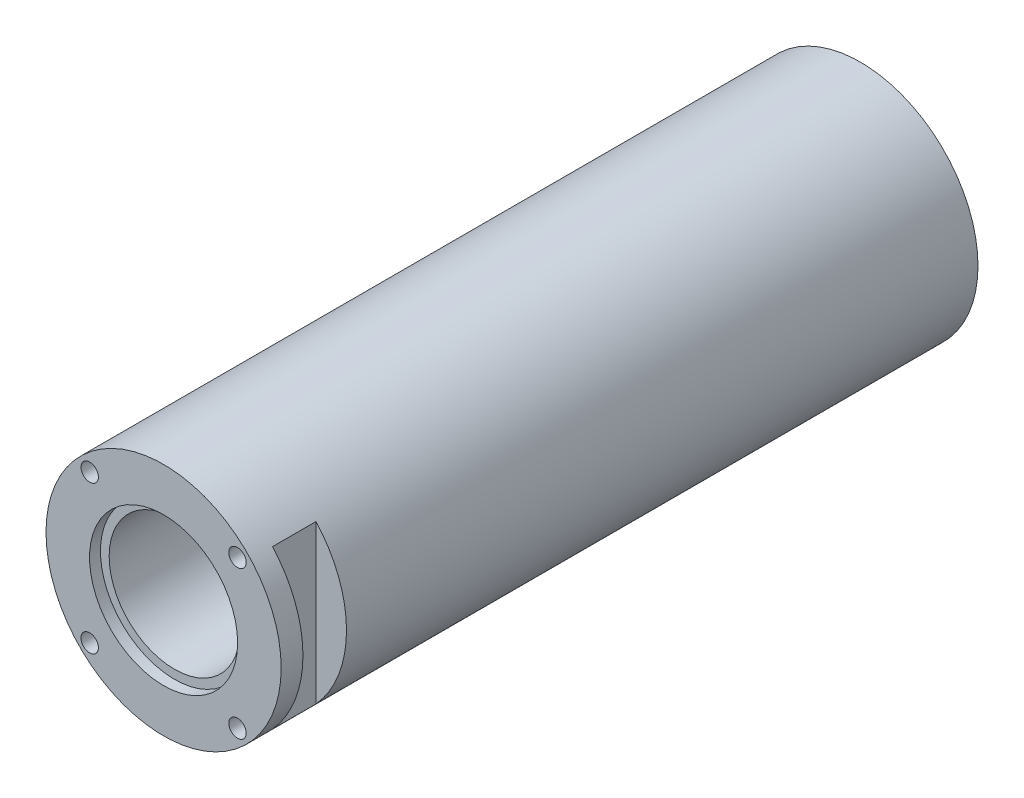
ISO-10303-21;
HEADER;
FILE_DESCRIPTION(('STEP AP214'),'2;1');
FILE_NAME('part.step','',(''),(''),'','','');
FILE_SCHEMA(('AUTOMOTIVE_DESIGN { 1 0 10303 214 1 1 1 1 }'));
ENDSEC;
DATA;
#1=APPLICATION_CONTEXT('core data for automotive mechanical design processes');
#2=APPLICATION_PROTOCOL_DEFINITION('international standard','automotive_design',2000,#1);
#3=PRODUCT_CONTEXT('',#1,'mechanical');
#4=PRODUCT('Part','Part','',(#3));
#5=PRODUCT_RELATED_PRODUCT_CATEGORY('part','',(#4));
#6=PRODUCT_DEFINITION_FORMATION('','',#4);
#7=PRODUCT_DEFINITION_CONTEXT('part definition',#1,'design');
#8=PRODUCT_DEFINITION('design','',#6,#7);
#9=PRODUCT_DEFINITION_SHAPE('','',#8);
#10=(LENGTH_UNIT() NAMED_UNIT(*) SI_UNIT(.MILLI.,.METRE.));
#11=(NAMED_UNIT(*) PLANE_ANGLE_UNIT() SI_UNIT($,.RADIAN.));
#12=(NAMED_UNIT(*) SI_UNIT($,.STERADIAN.) SOLID_ANGLE_UNIT());
#13=UNCERTAINTY_MEASURE_WITH_UNIT(LENGTH_MEASURE(1.E-05),#10,'distance_accuracy_value','');
#14=(GEOMETRIC_REPRESENTATION_CONTEXT(3) GLOBAL_UNCERTAINTY_ASSIGNED_CONTEXT((#13)) GLOBAL_UNIT_ASSIGNED_CONTEXT((#10,
#11,#12)) REPRESENTATION_CONTEXT('',''));
#15=CARTESIAN_POINT('',(0.,0.,0.));
#16=DIRECTION('',(0.,0.,1.));
#17=DIRECTION('',(1.,0.,0.));
#18=AXIS2_PLACEMENT_3D('',#15,#16,#17);
#19=CARTESIAN_POINT('',(0.,0.,160.));
#20=DIRECTION('',(0.,0.,-1.));
#21=DIRECTION('',(-1.,0.,0.));
#22=AXIS2_PLACEMENT_3D('',#19,#20,#21);
#23=CYLINDRICAL_SURFACE('',#22,15.);
#24=CARTESIAN_POINT('',(0.,0.,157.5));
#25=DIRECTION('',(0.,0.,1.));
#26=DIRECTION('',(1.,0.,0.));
#27=AXIS2_PLACEMENT_3D('',#24,#25,#26);
#28=CIRCLE('',#27,15.);
#29=CARTESIAN_POINT('',(15.,0.,157.5));
#30=VERTEX_POINT('',#29);
#31=EDGE_CURVE('E180',#30,#30,#28,.T.);
#32=ORIENTED_EDGE('',*,*,#31,.T.);
#33=EDGE_LOOP('',(#32));
#34=FACE_BOUND('',#33,.T.);
#35=CARTESIAN_POINT('',(0.,0.,2.5));
#36=DIRECTION('',(0.,0.,-1.));
#37=DIRECTION('',(-1.,0.,0.));
#38=AXIS2_PLACEMENT_3D('',#35,#36,#37);
#39=CIRCLE('',#38,15.);
#40=CARTESIAN_POINT('',(-15.,0.,2.5));
#41=VERTEX_POINT('',#40);
#42=EDGE_CURVE('E189',#41,#41,#39,.T.);
#43=ORIENTED_EDGE('',*,*,#42,.T.);
#44=EDGE_LOOP('',(#43));
#45=FACE_BOUND('',#44,.T.);
#46=ADVANCED_FACE('F31',(#34,#45),#23,.F.);
#47=CARTESIAN_POINT('',(0.,0.,160.));
#48=DIRECTION('',(0.,0.,1.));
#49=DIRECTION('',(1.,0.,0.));
#50=AXIS2_PLACEMENT_3D('',#47,#48,#49);
#51=PLANE('',#50);
#52=CARTESIAN_POINT('',(0.,0.,160.));
#53=DIRECTION('',(0.,0.,1.));
#54=DIRECTION('',(1.,0.,0.));
#55=AXIS2_PLACEMENT_3D('',#52,#53,#54);
#56=CIRCLE('',#55,17.);
#57=CARTESIAN_POINT('',(17.,0.,160.));
#58=VERTEX_POINT('',#57);
#59=EDGE_CURVE('E177',#58,#58,#56,.T.);
#60=ORIENTED_EDGE('',*,*,#59,.F.);
#61=EDGE_LOOP('',(#60));
#62=FACE_BOUND('',#61,.T.);
#63=CARTESIAN_POINT('',(-16.9711120913422,16.9710956732872,160.));
#64=DIRECTION('',(0.,0.,1.));
#65=DIRECTION('',(1.,0.,0.));
#66=AXIS2_PLACEMENT_3D('',#63,#64,#65);
#67=CIRCLE('',#66,2.00000000000066);
#68=CARTESIAN_POINT('',(-14.9711120913415,16.9710956732872,160.));
#69=VERTEX_POINT('',#68);
#70=EDGE_CURVE('E147',#69,#69,#67,.T.);
#71=ORIENTED_EDGE('',*,*,#70,.F.);
#72=EDGE_LOOP('',(#71));
#73=FACE_BOUND('',#72,.T.);
#74=CARTESIAN_POINT('',(-16.9711120913418,-16.970029823667,160.));
#75=DIRECTION('',(0.,0.,1.));
#76=DIRECTION('',(1.,0.,0.));
#77=AXIS2_PLACEMENT_3D('',#74,#75,#76);
#78=CIRCLE('',#77,2.00000000000081);
#79=CARTESIAN_POINT('',(-14.971112091341,-16.970029823667,160.));
#80=VERTEX_POINT('',#79);
#81=EDGE_CURVE('E141',#80,#80,#78,.T.);
#82=ORIENTED_EDGE('',*,*,#81,.F.);
#83=EDGE_LOOP('',(#82));
#84=FACE_BOUND('',#83,.T.);
#85=CARTESIAN_POINT('',(16.970013405612,-16.9700298236667,160.));
#86=DIRECTION('',(0.,0.,1.));
#87=DIRECTION('',(1.,0.,0.));
#88=AXIS2_PLACEMENT_3D('',#85,#86,#87);
#89=CIRCLE('',#88,2.);
#90=CARTESIAN_POINT('',(18.970013405612,-16.9700298236667,160.));
#91=VERTEX_POINT('',#90);
#92=EDGE_CURVE('E135',#91,#91,#89,.T.);
#93=ORIENTED_EDGE('',*,*,#92,.F.);
#94=EDGE_LOOP('',(#93));
#95=FACE_BOUND('',#94,.T.);
#96=CARTESIAN_POINT('',(16.9700134056121,16.9710956732877,160.));
#97=DIRECTION('',(0.,0.,1.));
#98=DIRECTION('',(1.,0.,0.));
#99=AXIS2_PLACEMENT_3D('',#96,#97,#98);
#100=CIRCLE('',#99,2.);
#101=CARTESIAN_POINT('',(18.9700134056121,16.9710956732877,160.));
#102=VERTEX_POINT('',#101);
#103=EDGE_CURVE('E129',#102,#102,#100,.T.);
#104=ORIENTED_EDGE('',*,*,#103,.F.);
#105=EDGE_LOOP('',(#104));
#106=FACE_BOUND('',#105,.T.);
#107=CARTESIAN_POINT('',(0.,0.,160.));
#108=DIRECTION('',(0.,0.,1.));
#109=DIRECTION('',(1.,0.,0.));
#110=AXIS2_PLACEMENT_3D('',#107,#108,#109);
#111=CIRCLE('',#110,27.);
#112=CARTESIAN_POINT('',(27.,0.,160.));
#113=VERTEX_POINT('',#112);
#114=EDGE_CURVE('E122',#113,#113,#111,.T.);
#115=ORIENTED_EDGE('',*,*,#114,.T.);
#116=EDGE_LOOP('',(#115));
#117=FACE_BOUND('',#116,.T.);
#118=ADVANCED_FACE('F218',(#62,#73,#84,#95,#106,#117),#51,.T.);
#119=CARTESIAN_POINT('',(0.,0.,0.));
#120=DIRECTION('',(0.,0.,1.));
#121=DIRECTION('',(1.,0.,0.));
#122=AXIS2_PLACEMENT_3D('',#119,#120,#121);
#123=PLANE('',#122);
#124=CARTESIAN_POINT('',(0.,0.,0.));
#125=DIRECTION('',(0.,0.,-1.));
#126=DIRECTION('',(-1.,0.,0.));
#127=AXIS2_PLACEMENT_3D('',#124,#125,#126);
#128=CIRCLE('',#127,17.);
#129=CARTESIAN_POINT('',(-17.,0.,0.));
#130=VERTEX_POINT('',#129);
#131=EDGE_CURVE('E186',#130,#130,#128,.T.);
#132=ORIENTED_EDGE('',*,*,#131,.F.);
#133=EDGE_LOOP('',(#132));
#134=FACE_BOUND('',#133,.T.);
#135=CARTESIAN_POINT('',(16.9711120913422,16.9710956732872,0.));
#136=DIRECTION('',(0.,0.,-1.));
#137=DIRECTION('',(-1.,0.,0.));
#138=AXIS2_PLACEMENT_3D('',#135,#136,#137);
#139=CIRCLE('',#138,2.00000000000066);
#140=CARTESIAN_POINT('',(14.9711120913415,16.9710956732872,0.));
#141=VERTEX_POINT('',#140);
#142=EDGE_CURVE('E171',#141,#141,#139,.T.);
#143=ORIENTED_EDGE('',*,*,#142,.F.);
#144=EDGE_LOOP('',(#143));
#145=FACE_BOUND('',#144,.T.);
#146=CARTESIAN_POINT('',(16.9711120913418,-16.970029823667,0.));
#147=DIRECTION('',(0.,0.,-1.));
#148=DIRECTION('',(-1.,0.,0.));
#149=AXIS2_PLACEMENT_3D('',#146,#147,#148);
#150=CIRCLE('',#149,2.00000000000081);
#151=CARTESIAN_POINT('',(14.971112091341,-16.970029823667,0.));
#152=VERTEX_POINT('',#151);
#153=EDGE_CURVE('E165',#152,#152,#150,.T.);
#154=ORIENTED_EDGE('',*,*,#153,.F.);
#155=EDGE_LOOP('',(#154));
#156=FACE_BOUND('',#155,.T.);
#157=CARTESIAN_POINT('',(-16.970013405612,-16.9700298236667,0.));
#158=DIRECTION('',(0.,0.,-1.));
#159=DIRECTION('',(-1.,0.,0.));
#160=AXIS2_PLACEMENT_3D('',#157,#158,#159);
#161=CIRCLE('',#160,2.);
#162=CARTESIAN_POINT('',(-18.970013405612,-16.9700298236667,0.));
#163=VERTEX_POINT('',#162);
#164=EDGE_CURVE('E159',#163,#163,#161,.T.);
#165=ORIENTED_EDGE('',*,*,#164,.F.);
#166=EDGE_LOOP('',(#165));
#167=FACE_BOUND('',#166,.T.);
#168=CARTESIAN_POINT('',(-16.9700134056121,16.9710956732877,0.));
#169=DIRECTION('',(0.,0.,-1.));
#170=DIRECTION('',(-1.,0.,0.));
#171=AXIS2_PLACEMENT_3D('',#168,#169,#170);
#172=CIRCLE('',#171,2.);
#173=CARTESIAN_POINT('',(-18.9700134056121,16.9710956732877,0.));
#174=VERTEX_POINT('',#173);
#175=EDGE_CURVE('E153',#174,#174,#172,.T.);
#176=ORIENTED_EDGE('',*,*,#175,.F.);
#177=EDGE_LOOP('',(#176));
#178=FACE_BOUND('',#177,.T.);
#179=CARTESIAN_POINT('',(0.,0.,0.));
#180=DIRECTION('',(0.,0.,1.));
#181=DIRECTION('',(1.,0.,0.));
#182=AXIS2_PLACEMENT_3D('',#179,#180,#181);
#183=CIRCLE('',#182,27.);
#184=CARTESIAN_POINT('',(27.,0.,0.));
#185=VERTEX_POINT('',#184);
#186=EDGE_CURVE('E123',#185,#185,#183,.T.);
#187=ORIENTED_EDGE('',*,*,#186,.F.);
#188=EDGE_LOOP('',(#187));
#189=FACE_BOUND('',#188,.T.);
#190=ADVANCED_FACE('F224',(#134,#145,#156,#167,#178,#189),#123,.F.);
#191=CARTESIAN_POINT('',(0.,0.,160.));
#192=DIRECTION('',(0.,0.,-1.));
#193=DIRECTION('',(-1.,0.,0.));
#194=AXIS2_PLACEMENT_3D('',#191,#192,#193);
#195=CYLINDRICAL_SURFACE('',#194,27.);
#196=DIRECTION('',(0.,0.,-1.));
#197=VECTOR('',#196,1.);
#198=CARTESIAN_POINT('',(-20.,18.1383571472171,160.));
#199=LINE('',#198,#197);
#200=CARTESIAN_POINT('',(-20.,18.138357147217,145.));
#201=VERTEX_POINT('',#200);
#202=CARTESIAN_POINT('',(-20.,18.1383571472171,155.));
#203=VERTEX_POINT('',#202);
#204=EDGE_CURVE('E11',#201,#203,#199,.F.);
#205=ORIENTED_EDGE('',*,*,#204,.T.);
#206=CARTESIAN_POINT('',(0.,0.,155.));
#207=DIRECTION('',(0.,0.,1.));
#208=DIRECTION('',(1.,0.,0.));
#209=AXIS2_PLACEMENT_3D('',#206,#207,#208);
#210=CIRCLE('',#209,27.);
#211=CARTESIAN_POINT('',(-20.,-18.1383571472171,155.));
#212=VERTEX_POINT('',#211);
#213=EDGE_CURVE('E82',#203,#212,#210,.T.);
#214=ORIENTED_EDGE('',*,*,#213,.T.);
#215=DIRECTION('',(0.,0.,-1.));
#216=VECTOR('',#215,1.);
#217=CARTESIAN_POINT('',(-20.,-18.1383571472171,160.));
#218=LINE('',#217,#216);
#219=CARTESIAN_POINT('',(-20.,-18.1383571472171,145.));
#220=VERTEX_POINT('',#219);
#221=EDGE_CURVE('E86',#212,#220,#218,.T.);
#222=ORIENTED_EDGE('',*,*,#221,.T.);
#223=CARTESIAN_POINT('',(0.,0.,145.));
#224=DIRECTION('',(0.,0.,-1.));
#225=DIRECTION('',(-1.,0.,0.));
#226=AXIS2_PLACEMENT_3D('',#223,#224,#225);
#227=CIRCLE('',#226,27.);
#228=EDGE_CURVE('E39',#220,#201,#227,.T.);
#229=ORIENTED_EDGE('',*,*,#228,.T.);
#230=EDGE_LOOP('',(#205,#214,#222,#229));
#231=FACE_BOUND('',#230,.T.);
#232=CARTESIAN_POINT('',(0.,0.,155.));
#233=DIRECTION('',(0.,0.,1.));
#234=DIRECTION('',(1.,0.,0.));
#235=AXIS2_PLACEMENT_3D('',#232,#233,#234);
#236=CIRCLE('',#235,27.);
#237=CARTESIAN_POINT('',(20.,-18.1383571472171,155.));
#238=VERTEX_POINT('',#237);
#239=CARTESIAN_POINT('',(20.,18.138357147217,155.));
#240=VERTEX_POINT('',#239);
#241=EDGE_CURVE('E87',#238,#240,#236,.T.);
#242=ORIENTED_EDGE('',*,*,#241,.T.);
#243=DIRECTION('',(0.,0.,-1.));
#244=VECTOR('',#243,1.);
#245=CARTESIAN_POINT('',(20.,18.1383571472171,160.));
#246=LINE('',#245,#244);
#247=CARTESIAN_POINT('',(20.,18.1383571472171,145.));
#248=VERTEX_POINT('',#247);
#249=EDGE_CURVE('E101',#240,#248,#246,.T.);
#250=ORIENTED_EDGE('',*,*,#249,.T.);
#251=CARTESIAN_POINT('',(0.,0.,145.));
#252=DIRECTION('',(0.,0.,-1.));
#253=DIRECTION('',(-1.,0.,0.));
#254=AXIS2_PLACEMENT_3D('',#251,#252,#253);
#255=CIRCLE('',#254,27.);
#256=CARTESIAN_POINT('',(20.,-18.1383571472171,145.));
#257=VERTEX_POINT('',#256);
#258=EDGE_CURVE('E107',#248,#257,#255,.T.);
#259=ORIENTED_EDGE('',*,*,#258,.T.);
#260=DIRECTION('',(0.,0.,-1.));
#261=VECTOR('',#260,1.);
#262=CARTESIAN_POINT('',(20.,-18.1383571472171,160.));
#263=LINE('',#262,#261);
#264=EDGE_CURVE('E104',#257,#238,#263,.F.);
#265=ORIENTED_EDGE('',*,*,#264,.T.);
#266=EDGE_LOOP('',(#242,#250,#259,#265));
#267=FACE_BOUND('',#266,.T.);
#268=DIRECTION('',(0.,0.,-1.));
#269=VECTOR('',#268,1.);
#270=CARTESIAN_POINT('',(16.9705627484771,-21.,160.));
#271=LINE('',#270,#269);
#272=CARTESIAN_POINT('',(16.9705627484771,-21.,140.));
#273=VERTEX_POINT('',#272);
#274=CARTESIAN_POINT('',(16.9705627484771,-21.,20.));
#275=VERTEX_POINT('',#274);
#276=EDGE_CURVE('E110',#273,#275,#271,.T.);
#277=ORIENTED_EDGE('',*,*,#276,.T.);
#278=CARTESIAN_POINT('',(0.,0.,20.));
#279=DIRECTION('',(0.,0.,-1.));
#280=DIRECTION('',(0.,1.,0.));
#281=AXIS2_PLACEMENT_3D('',#278,#279,#280);
#282=CIRCLE('',#281,27.);
#283=CARTESIAN_POINT('',(-16.9705627484771,-21.,20.));
#284=VERTEX_POINT('',#283);
#285=EDGE_CURVE('E119',#275,#284,#282,.T.);
#286=ORIENTED_EDGE('',*,*,#285,.T.);
#287=DIRECTION('',(0.,0.,-1.));
#288=VECTOR('',#287,1.);
#289=CARTESIAN_POINT('',(-16.9705627484771,-21.,160.));
#290=LINE('',#289,#288);
#291=CARTESIAN_POINT('',(-16.9705627484771,-21.,140.));
#292=VERTEX_POINT('',#291);
#293=EDGE_CURVE('E116',#284,#292,#290,.F.);
#294=ORIENTED_EDGE('',*,*,#293,.T.);
#295=CARTESIAN_POINT('',(0.,0.,140.));
#296=DIRECTION('',(0.,0.,1.));
#297=DIRECTION('',(1.,0.,0.));
#298=AXIS2_PLACEMENT_3D('',#295,#296,#297);
#299=CIRCLE('',#298,27.);
#300=EDGE_CURVE('E113',#292,#273,#299,.T.);
#301=ORIENTED_EDGE('',*,*,#300,.T.);
#302=EDGE_LOOP('',(#277,#286,#294,#301));
#303=FACE_BOUND('',#302,.T.);
#304=ORIENTED_EDGE('',*,*,#114,.F.);
#305=EDGE_LOOP('',(#304));
#306=FACE_BOUND('',#305,.T.);
#307=ORIENTED_EDGE('',*,*,#186,.T.);
#308=EDGE_LOOP('',(#307));
#309=FACE_BOUND('',#308,.T.);
#310=ADVANCED_FACE('F33',(#231,#267,#303,#306,#309),#195,.T.);
#311=CARTESIAN_POINT('',(16.9700134056121,16.9710956732877,145.));
#312=DIRECTION('',(0.,0.,1.));
#313=DIRECTION('',(1.,0.,0.));
#314=AXIS2_PLACEMENT_3D('',#311,#312,#313);
#315=CYLINDRICAL_SURFACE('',#314,2.);
#316=CARTESIAN_POINT('',(16.9700134056121,16.9710956732877,145.));
#317=DIRECTION('',(0.,0.,1.));
#318=DIRECTION('',(1.,0.,0.));
#319=AXIS2_PLACEMENT_3D('',#316,#317,#318);
#320=CIRCLE('',#319,2.);
#321=CARTESIAN_POINT('',(18.9700134056121,16.9710956732877,145.));
#322=VERTEX_POINT('',#321);
#323=EDGE_CURVE('E126',#322,#322,#320,.T.);
#324=ORIENTED_EDGE('',*,*,#323,.F.);
#325=EDGE_LOOP('',(#324));
#326=FACE_BOUND('',#325,.T.);
#327=ORIENTED_EDGE('',*,*,#103,.T.);
#328=EDGE_LOOP('',(#327));
#329=FACE_BOUND('',#328,.T.);
#330=ADVANCED_FACE('F229',(#326,#329),#315,.F.);
#331=CARTESIAN_POINT('',(16.9700134056121,16.9710956732877,145.));
#332=DIRECTION('',(0.,0.,1.));
#333=DIRECTION('',(1.,0.,0.));
#334=AXIS2_PLACEMENT_3D('',#331,#332,#333);
#335=PLANE('',#334);
#336=ORIENTED_EDGE('',*,*,#323,.T.);
#337=EDGE_LOOP('',(#336));
#338=FACE_BOUND('',#337,.T.);
#339=ADVANCED_FACE('F285',(#338),#335,.T.);
#340=CARTESIAN_POINT('',(16.970013405612,-16.9700298236667,145.));
#341=DIRECTION('',(0.,0.,1.));
#342=DIRECTION('',(1.,0.,0.));
#343=AXIS2_PLACEMENT_3D('',#340,#341,#342);
#344=CYLINDRICAL_SURFACE('',#343,2.);
#345=CARTESIAN_POINT('',(16.970013405612,-16.9700298236667,145.));
#346=DIRECTION('',(0.,0.,1.));
#347=DIRECTION('',(1.,0.,0.));
#348=AXIS2_PLACEMENT_3D('',#345,#346,#347);
#349=CIRCLE('',#348,2.);
#350=CARTESIAN_POINT('',(18.970013405612,-16.9700298236667,145.));
#351=VERTEX_POINT('',#350);
#352=EDGE_CURVE('E132',#351,#351,#349,.T.);
#353=ORIENTED_EDGE('',*,*,#352,.F.);
#354=EDGE_LOOP('',(#353));
#355=FACE_BOUND('',#354,.T.);
#356=ORIENTED_EDGE('',*,*,#92,.T.);
#357=EDGE_LOOP('',(#356));
#358=FACE_BOUND('',#357,.T.);
#359=ADVANCED_FACE('F282',(#355,#358),#344,.F.);
#360=CARTESIAN_POINT('',(16.970013405612,-16.9700298236667,145.));
#361=DIRECTION('',(0.,0.,1.));
#362=DIRECTION('',(1.,0.,0.));
#363=AXIS2_PLACEMENT_3D('',#360,#361,#362);
#364=PLANE('',#363);
#365=ORIENTED_EDGE('',*,*,#352,.T.);
#366=EDGE_LOOP('',(#365));
#367=FACE_BOUND('',#366,.T.);
#368=ADVANCED_FACE('F278',(#367),#364,.T.);
#369=CARTESIAN_POINT('',(-16.9711120913418,-16.970029823667,145.));
#370=DIRECTION('',(0.,0.,1.));
#371=DIRECTION('',(1.,0.,0.));
#372=AXIS2_PLACEMENT_3D('',#369,#370,#371);
#373=CYLINDRICAL_SURFACE('',#372,2.00000000000081);
#374=CARTESIAN_POINT('',(-16.9711120913418,-16.970029823667,145.));
#375=DIRECTION('',(0.,0.,1.));
#376=DIRECTION('',(1.,0.,0.));
#377=AXIS2_PLACEMENT_3D('',#374,#375,#376);
#378=CIRCLE('',#377,2.00000000000081);
#379=CARTESIAN_POINT('',(-14.971112091341,-16.970029823667,145.));
#380=VERTEX_POINT('',#379);
#381=EDGE_CURVE('E138',#380,#380,#378,.T.);
#382=ORIENTED_EDGE('',*,*,#381,.F.);
#383=EDGE_LOOP('',(#382));
#384=FACE_BOUND('',#383,.T.);
#385=ORIENTED_EDGE('',*,*,#81,.T.);
#386=EDGE_LOOP('',(#385));
#387=FACE_BOUND('',#386,.T.);
#388=ADVANCED_FACE('F274',(#384,#387),#373,.F.);
#389=CARTESIAN_POINT('',(-16.9711120913418,-16.970029823667,145.));
#390=DIRECTION('',(0.,0.,1.));
#391=DIRECTION('',(1.,0.,0.));
#392=AXIS2_PLACEMENT_3D('',#389,#390,#391);
#393=PLANE('',#392);
#394=ORIENTED_EDGE('',*,*,#381,.T.);
#395=EDGE_LOOP('',(#394));
#396=FACE_BOUND('',#395,.T.);
#397=ADVANCED_FACE('F270',(#396),#393,.T.);
#398=CARTESIAN_POINT('',(-16.9711120913422,16.9710956732872,145.));
#399=DIRECTION('',(0.,0.,1.));
#400=DIRECTION('',(1.,0.,0.));
#401=AXIS2_PLACEMENT_3D('',#398,#399,#400);
#402=CYLINDRICAL_SURFACE('',#401,2.00000000000066);
#403=CARTESIAN_POINT('',(-16.9711120913422,16.9710956732872,145.));
#404=DIRECTION('',(0.,0.,1.));
#405=DIRECTION('',(1.,0.,0.));
#406=AXIS2_PLACEMENT_3D('',#403,#404,#405);
#407=CIRCLE('',#406,2.00000000000066);
#408=CARTESIAN_POINT('',(-14.9711120913415,16.9710956732872,145.));
#409=VERTEX_POINT('',#408);
#410=EDGE_CURVE('E144',#409,#409,#407,.T.);
#411=ORIENTED_EDGE('',*,*,#410,.F.);
#412=EDGE_LOOP('',(#411));
#413=FACE_BOUND('',#412,.T.);
#414=ORIENTED_EDGE('',*,*,#70,.T.);
#415=EDGE_LOOP('',(#414));
#416=FACE_BOUND('',#415,.T.);
#417=ADVANCED_FACE('F262',(#413,#416),#402,.F.);
#418=CARTESIAN_POINT('',(-16.9711120913422,16.9710956732872,145.));
#419=DIRECTION('',(0.,0.,1.));
#420=DIRECTION('',(1.,0.,0.));
#421=AXIS2_PLACEMENT_3D('',#418,#419,#420);
#422=PLANE('',#421);
#423=ORIENTED_EDGE('',*,*,#410,.T.);
#424=EDGE_LOOP('',(#423));
#425=FACE_BOUND('',#424,.T.);
#426=ADVANCED_FACE('F252',(#425),#422,.T.);
#427=CARTESIAN_POINT('',(-16.9700134056121,16.9710956732877,15.));
#428=DIRECTION('',(0.,0.,-1.));
#429=DIRECTION('',(-1.,0.,0.));
#430=AXIS2_PLACEMENT_3D('',#427,#428,#429);
#431=CYLINDRICAL_SURFACE('',#430,2.);
#432=CARTESIAN_POINT('',(-16.9700134056121,16.9710956732877,15.));
#433=DIRECTION('',(0.,0.,-1.));
#434=DIRECTION('',(-1.,0.,0.));
#435=AXIS2_PLACEMENT_3D('',#432,#433,#434);
#436=CIRCLE('',#435,2.);
#437=CARTESIAN_POINT('',(-18.9700134056121,16.9710956732877,15.));
#438=VERTEX_POINT('',#437);
#439=EDGE_CURVE('E150',#438,#438,#436,.T.);
#440=ORIENTED_EDGE('',*,*,#439,.F.);
#441=EDGE_LOOP('',(#440));
#442=FACE_BOUND('',#441,.T.);
#443=ORIENTED_EDGE('',*,*,#175,.T.);
#444=EDGE_LOOP('',(#443));
#445=FACE_BOUND('',#444,.T.);
#446=ADVANCED_FACE('F249',(#442,#445),#431,.F.);
#447=CARTESIAN_POINT('',(-16.9700134056121,16.9710956732877,15.));
#448=DIRECTION('',(0.,0.,-1.));
#449=DIRECTION('',(-1.,0.,0.));
#450=AXIS2_PLACEMENT_3D('',#447,#448,#449);
#451=PLANE('',#450);
#452=ORIENTED_EDGE('',*,*,#439,.T.);
#453=EDGE_LOOP('',(#452));
#454=FACE_BOUND('',#453,.T.);
#455=ADVANCED_FACE('F251',(#454),#451,.T.);
#456=CARTESIAN_POINT('',(-16.970013405612,-16.9700298236667,15.));
#457=DIRECTION('',(0.,0.,-1.));
#458=DIRECTION('',(-1.,0.,0.));
#459=AXIS2_PLACEMENT_3D('',#456,#457,#458);
#460=CYLINDRICAL_SURFACE('',#459,2.);
#461=CARTESIAN_POINT('',(-16.970013405612,-16.9700298236667,15.));
#462=DIRECTION('',(0.,0.,-1.));
#463=DIRECTION('',(-1.,0.,0.));
#464=AXIS2_PLACEMENT_3D('',#461,#462,#463);
#465=CIRCLE('',#464,2.);
#466=CARTESIAN_POINT('',(-18.970013405612,-16.9700298236667,15.));
#467=VERTEX_POINT('',#466);
#468=EDGE_CURVE('E156',#467,#467,#465,.T.);
#469=ORIENTED_EDGE('',*,*,#468,.F.);
#470=EDGE_LOOP('',(#469));
#471=FACE_BOUND('',#470,.T.);
#472=ORIENTED_EDGE('',*,*,#164,.T.);
#473=EDGE_LOOP('',(#472));
#474=FACE_BOUND('',#473,.T.);
#475=ADVANCED_FACE('F259',(#471,#474),#460,.F.);
#476=CARTESIAN_POINT('',(-16.970013405612,-16.9700298236667,15.));
#477=DIRECTION('',(0.,0.,-1.));
#478=DIRECTION('',(-1.,0.,0.));
#479=AXIS2_PLACEMENT_3D('',#476,#477,#478);
#480=PLANE('',#479);
#481=ORIENTED_EDGE('',*,*,#468,.T.);
#482=EDGE_LOOP('',(#481));
#483=FACE_BOUND('',#482,.T.);
#484=ADVANCED_FACE('F401',(#483),#480,.T.);
#485=CARTESIAN_POINT('',(16.9711120913418,-16.970029823667,15.));
#486=DIRECTION('',(0.,0.,-1.));
#487=DIRECTION('',(-1.,0.,0.));
#488=AXIS2_PLACEMENT_3D('',#485,#486,#487);
#489=CYLINDRICAL_SURFACE('',#488,2.00000000000081);
#490=CARTESIAN_POINT('',(16.9711120913418,-16.970029823667,15.));
#491=DIRECTION('',(0.,0.,-1.));
#492=DIRECTION('',(-1.,0.,0.));
#493=AXIS2_PLACEMENT_3D('',#490,#491,#492);
#494=CIRCLE('',#493,2.00000000000081);
#495=CARTESIAN_POINT('',(14.971112091341,-16.970029823667,15.));
#496=VERTEX_POINT('',#495);
#497=EDGE_CURVE('E162',#496,#496,#494,.T.);
#498=ORIENTED_EDGE('',*,*,#497,.F.);
#499=EDGE_LOOP('',(#498));
#500=FACE_BOUND('',#499,.T.);
#501=ORIENTED_EDGE('',*,*,#153,.T.);
#502=EDGE_LOOP('',(#501));
#503=FACE_BOUND('',#502,.T.);
#504=ADVANCED_FACE('F397',(#500,#503),#489,.F.);
#505=CARTESIAN_POINT('',(16.9711120913418,-16.970029823667,15.));
#506=DIRECTION('',(0.,0.,-1.));
#507=DIRECTION('',(-1.,0.,0.));
#508=AXIS2_PLACEMENT_3D('',#505,#506,#507);
#509=PLANE('',#508);
#510=ORIENTED_EDGE('',*,*,#497,.T.);
#511=EDGE_LOOP('',(#510));
#512=FACE_BOUND('',#511,.T.);
#513=ADVANCED_FACE('F393',(#512),#509,.T.);
#514=CARTESIAN_POINT('',(16.9711120913422,16.9710956732872,15.));
#515=DIRECTION('',(0.,0.,-1.));
#516=DIRECTION('',(-1.,0.,0.));
#517=AXIS2_PLACEMENT_3D('',#514,#515,#516);
#518=CYLINDRICAL_SURFACE('',#517,2.00000000000066);
#519=CARTESIAN_POINT('',(16.9711120913422,16.9710956732872,15.));
#520=DIRECTION('',(0.,0.,-1.));
#521=DIRECTION('',(-1.,0.,0.));
#522=AXIS2_PLACEMENT_3D('',#519,#520,#521);
#523=CIRCLE('',#522,2.00000000000066);
#524=CARTESIAN_POINT('',(14.9711120913415,16.9710956732872,15.));
#525=VERTEX_POINT('',#524);
#526=EDGE_CURVE('E168',#525,#525,#523,.T.);
#527=ORIENTED_EDGE('',*,*,#526,.F.);
#528=EDGE_LOOP('',(#527));
#529=FACE_BOUND('',#528,.T.);
#530=ORIENTED_EDGE('',*,*,#142,.T.);
#531=EDGE_LOOP('',(#530));
#532=FACE_BOUND('',#531,.T.);
#533=ADVANCED_FACE('F389',(#529,#532),#518,.F.);
#534=CARTESIAN_POINT('',(16.9711120913422,16.9710956732872,15.));
#535=DIRECTION('',(0.,0.,-1.));
#536=DIRECTION('',(-1.,0.,0.));
#537=AXIS2_PLACEMENT_3D('',#534,#535,#536);
#538=PLANE('',#537);
#539=ORIENTED_EDGE('',*,*,#526,.T.);
#540=EDGE_LOOP('',(#539));
#541=FACE_BOUND('',#540,.T.);
#542=ADVANCED_FACE('F385',(#541),#538,.T.);
#543=CARTESIAN_POINT('',(0.,0.,157.5));
#544=DIRECTION('',(0.,0.,1.));
#545=DIRECTION('',(1.,0.,0.));
#546=AXIS2_PLACEMENT_3D('',#543,#544,#545);
#547=CYLINDRICAL_SURFACE('',#546,17.);
#548=CARTESIAN_POINT('',(0.,0.,157.5));
#549=DIRECTION('',(0.,0.,1.));
#550=DIRECTION('',(1.,0.,0.));
#551=AXIS2_PLACEMENT_3D('',#548,#549,#550);
#552=CIRCLE('',#551,17.);
#553=CARTESIAN_POINT('',(17.,0.,157.5));
#554=VERTEX_POINT('',#553);
#555=EDGE_CURVE('E174',#554,#554,#552,.T.);
#556=ORIENTED_EDGE('',*,*,#555,.F.);
#557=EDGE_LOOP('',(#556));
#558=FACE_BOUND('',#557,.T.);
#559=ORIENTED_EDGE('',*,*,#59,.T.);
#560=EDGE_LOOP('',(#559));
#561=FACE_BOUND('',#560,.T.);
#562=ADVANCED_FACE('F381',(#558,#561),#547,.F.);
#563=CARTESIAN_POINT('',(0.,0.,157.5));
#564=DIRECTION('',(0.,0.,1.));
#565=DIRECTION('',(1.,0.,0.));
#566=AXIS2_PLACEMENT_3D('',#563,#564,#565);
#567=PLANE('',#566);
#568=ORIENTED_EDGE('',*,*,#31,.F.);
#569=EDGE_LOOP('',(#568));
#570=FACE_BOUND('',#569,.T.);
#571=ORIENTED_EDGE('',*,*,#555,.T.);
#572=EDGE_LOOP('',(#571));
#573=FACE_BOUND('',#572,.T.);
#574=ADVANCED_FACE('F377',(#570,#573),#567,.T.);
#575=CARTESIAN_POINT('',(0.,0.,2.5));
#576=DIRECTION('',(0.,0.,-1.));
#577=DIRECTION('',(-1.,0.,0.));
#578=AXIS2_PLACEMENT_3D('',#575,#576,#577);
#579=CYLINDRICAL_SURFACE('',#578,17.);
#580=CARTESIAN_POINT('',(0.,0.,2.5));
#581=DIRECTION('',(0.,0.,-1.));
#582=DIRECTION('',(-1.,0.,0.));
#583=AXIS2_PLACEMENT_3D('',#580,#581,#582);
#584=CIRCLE('',#583,17.);
#585=CARTESIAN_POINT('',(-17.,0.,2.5));
#586=VERTEX_POINT('',#585);
#587=EDGE_CURVE('E185',#586,#586,#584,.T.);
#588=ORIENTED_EDGE('',*,*,#587,.F.);
#589=EDGE_LOOP('',(#588));
#590=FACE_BOUND('',#589,.T.);
#591=ORIENTED_EDGE('',*,*,#131,.T.);
#592=EDGE_LOOP('',(#591));
#593=FACE_BOUND('',#592,.T.);
#594=ADVANCED_FACE('F373',(#590,#593),#579,.F.);
#595=CARTESIAN_POINT('',(0.,0.,2.5));
#596=DIRECTION('',(0.,0.,-1.));
#597=DIRECTION('',(-1.,0.,0.));
#598=AXIS2_PLACEMENT_3D('',#595,#596,#597);
#599=PLANE('',#598);
#600=ORIENTED_EDGE('',*,*,#42,.F.);
#601=EDGE_LOOP('',(#600));
#602=FACE_BOUND('',#601,.T.);
#603=ORIENTED_EDGE('',*,*,#587,.T.);
#604=EDGE_LOOP('',(#603));
#605=FACE_BOUND('',#604,.T.);
#606=ADVANCED_FACE('F369',(#602,#605),#599,.T.);
#607=CARTESIAN_POINT('',(-27.,-21.,140.));
#608=DIRECTION('',(0.,0.,1.));
#609=DIRECTION('',(1.,0.,0.));
#610=AXIS2_PLACEMENT_3D('',#607,#608,#609);
#611=PLANE('',#610);
#612=DIRECTION('',(1.,0.,0.));
#613=VECTOR('',#612,1.);
#614=CARTESIAN_POINT('',(-27.,-21.,140.));
#615=LINE('',#614,#613);
#616=EDGE_CURVE('E194',#292,#273,#615,.T.);
#617=ORIENTED_EDGE('',*,*,#616,.T.);
#618=ORIENTED_EDGE('',*,*,#300,.F.);
#619=EDGE_LOOP('',(#617,#618));
#620=FACE_BOUND('',#619,.T.);
#621=ADVANCED_FACE('F363',(#620),#611,.F.);
#622=CARTESIAN_POINT('',(-27.,-21.,140.));
#623=DIRECTION('',(0.,1.,0.));
#624=DIRECTION('',(0.,0.,1.));
#625=AXIS2_PLACEMENT_3D('',#622,#623,#624);
#626=PLANE('',#625);
#627=ORIENTED_EDGE('',*,*,#616,.F.);
#628=ORIENTED_EDGE('',*,*,#293,.F.);
#629=DIRECTION('',(1.,0.,0.));
#630=VECTOR('',#629,1.);
#631=CARTESIAN_POINT('',(-27.,-21.,20.));
#632=LINE('',#631,#630);
#633=EDGE_CURVE('E195',#284,#275,#632,.T.);
#634=ORIENTED_EDGE('',*,*,#633,.T.);
#635=ORIENTED_EDGE('',*,*,#276,.F.);
#636=EDGE_LOOP('',(#627,#628,#634,#635));
#637=FACE_BOUND('',#636,.T.);
#638=ADVANCED_FACE('F360',(#637),#626,.F.);
#639=CARTESIAN_POINT('',(-27.,-21.,20.));
#640=DIRECTION('',(0.,0.,-1.));
#641=DIRECTION('',(0.,1.,0.));
#642=AXIS2_PLACEMENT_3D('',#639,#640,#641);
#643=PLANE('',#642);
#644=ORIENTED_EDGE('',*,*,#633,.F.);
#645=ORIENTED_EDGE('',*,*,#285,.F.);
#646=EDGE_LOOP('',(#644,#645));
#647=FACE_BOUND('',#646,.T.);
#648=ADVANCED_FACE('F313',(#647),#643,.F.);
#649=CARTESIAN_POINT('',(27.,-27.,155.));
#650=DIRECTION('',(0.,0.,1.));
#651=DIRECTION('',(1.,0.,0.));
#652=AXIS2_PLACEMENT_3D('',#649,#650,#651);
#653=PLANE('',#652);
#654=ORIENTED_EDGE('',*,*,#241,.F.);
#655=DIRECTION('',(0.,1.,0.));
#656=VECTOR('',#655,1.);
#657=CARTESIAN_POINT('',(20.,-27.,155.));
#658=LINE('',#657,#656);
#659=EDGE_CURVE('E198',#238,#240,#658,.T.);
#660=ORIENTED_EDGE('',*,*,#659,.T.);
#661=EDGE_LOOP('',(#654,#660));
#662=FACE_BOUND('',#661,.T.);
#663=ADVANCED_FACE('F318',(#662),#653,.F.);
#664=CARTESIAN_POINT('',(20.,-27.,145.));
#665=DIRECTION('',(-1.,0.,0.));
#666=DIRECTION('',(0.,0.,1.));
#667=AXIS2_PLACEMENT_3D('',#664,#665,#666);
#668=PLANE('',#667);
#669=ORIENTED_EDGE('',*,*,#659,.F.);
#670=ORIENTED_EDGE('',*,*,#264,.F.);
#671=DIRECTION('',(0.,1.,0.));
#672=VECTOR('',#671,1.);
#673=CARTESIAN_POINT('',(20.,-27.,145.));
#674=LINE('',#673,#672);
#675=EDGE_CURVE('E52',#257,#248,#674,.T.);
#676=ORIENTED_EDGE('',*,*,#675,.T.);
#677=ORIENTED_EDGE('',*,*,#249,.F.);
#678=EDGE_LOOP('',(#669,#670,#676,#677));
#679=FACE_BOUND('',#678,.T.);
#680=ADVANCED_FACE('F213',(#679),#668,.F.);
#681=CARTESIAN_POINT('',(27.,-27.,145.));
#682=DIRECTION('',(0.,0.,-1.));
#683=DIRECTION('',(-1.,0.,0.));
#684=AXIS2_PLACEMENT_3D('',#681,#682,#683);
#685=PLANE('',#684);
#686=ORIENTED_EDGE('',*,*,#675,.F.);
#687=ORIENTED_EDGE('',*,*,#258,.F.);
#688=EDGE_LOOP('',(#686,#687));
#689=FACE_BOUND('',#688,.T.);
#690=ADVANCED_FACE('F206',(#689),#685,.F.);
#691=CARTESIAN_POINT('',(-27.,-27.,145.));
#692=DIRECTION('',(0.,0.,-1.));
#693=DIRECTION('',(-1.,0.,0.));
#694=AXIS2_PLACEMENT_3D('',#691,#692,#693);
#695=PLANE('',#694);
#696=ORIENTED_EDGE('',*,*,#228,.F.);
#697=DIRECTION('',(0.,1.,0.));
#698=VECTOR('',#697,1.);
#699=CARTESIAN_POINT('',(-20.,-27.,145.));
#700=LINE('',#699,#698);
#701=EDGE_CURVE('E94',#220,#201,#700,.T.);
#702=ORIENTED_EDGE('',*,*,#701,.T.);
#703=EDGE_LOOP('',(#696,#702));
#704=FACE_BOUND('',#703,.T.);
#705=ADVANCED_FACE('F204',(#704),#695,.F.);
#706=CARTESIAN_POINT('',(-20.,-27.,145.));
#707=DIRECTION('',(1.,0.,0.));
#708=DIRECTION('',(0.,0.,-1.));
#709=AXIS2_PLACEMENT_3D('',#706,#707,#708);
#710=PLANE('',#709);
#711=DIRECTION('',(0.,1.,0.));
#712=VECTOR('',#711,1.);
#713=CARTESIAN_POINT('',(-20.,-27.,155.));
#714=LINE('',#713,#712);
#715=EDGE_CURVE('E45',#212,#203,#714,.T.);
#716=ORIENTED_EDGE('',*,*,#715,.T.);
#717=ORIENTED_EDGE('',*,*,#204,.F.);
#718=ORIENTED_EDGE('',*,*,#701,.F.);
#719=ORIENTED_EDGE('',*,*,#221,.F.);
#720=EDGE_LOOP('',(#716,#717,#718,#719));
#721=FACE_BOUND('',#720,.T.);
#722=ADVANCED_FACE('F91',(#721),#710,.F.);
#723=CARTESIAN_POINT('',(-27.,-27.,155.));
#724=DIRECTION('',(0.,0.,1.));
#725=DIRECTION('',(1.,0.,0.));
#726=AXIS2_PLACEMENT_3D('',#723,#724,#725);
#727=PLANE('',#726);
#728=ORIENTED_EDGE('',*,*,#715,.F.);
#729=ORIENTED_EDGE('',*,*,#213,.F.);
#730=EDGE_LOOP('',(#728,#729));
#731=FACE_BOUND('',#730,.T.);
#732=ADVANCED_FACE('F83',(#731),#727,.F.);
#733=CLOSED_SHELL('',(#46,#118,#190,#310,#330,#339,#359,#368,#388,#397,#417,#426,#446,#455,#475,
#484,#504,#513,#533,#542,#562,#574,#594,#606,#621,#638,#648,#663,#680,#690,#705,#722,#732));
#734=MANIFOLD_SOLID_BREP('B2',#733);
#735=ADVANCED_BREP_SHAPE_REPRESENTATION('',(#18,#734),#14);
#736=SHAPE_DEFINITION_REPRESENTATION(#9,#735);
ENDSEC;
END-ISO-10303-21;
